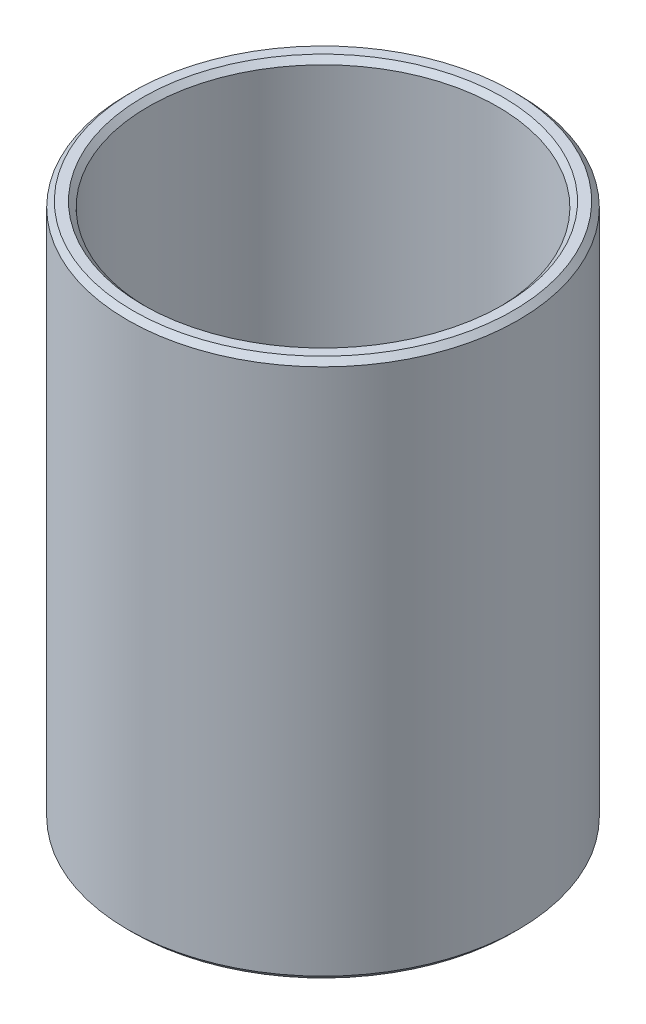
ISO-10303-21;
HEADER;
FILE_DESCRIPTION(('STEP AP214'),'2;1');
FILE_NAME('part.step','',(''),(''),'','','');
FILE_SCHEMA(('AUTOMOTIVE_DESIGN { 1 0 10303 214 1 1 1 1 }'));
ENDSEC;
DATA;
#1=APPLICATION_CONTEXT('core data for automotive mechanical design processes');
#2=APPLICATION_PROTOCOL_DEFINITION('international standard','automotive_design',2000,#1);
#3=PRODUCT_CONTEXT('',#1,'mechanical');
#4=PRODUCT('Part','Part','',(#3));
#5=PRODUCT_RELATED_PRODUCT_CATEGORY('part','',(#4));
#6=PRODUCT_DEFINITION_FORMATION('','',#4);
#7=PRODUCT_DEFINITION_CONTEXT('part definition',#1,'design');
#8=PRODUCT_DEFINITION('design','',#6,#7);
#9=PRODUCT_DEFINITION_SHAPE('','',#8);
#10=(LENGTH_UNIT() NAMED_UNIT(*) SI_UNIT(.MILLI.,.METRE.));
#11=(NAMED_UNIT(*) PLANE_ANGLE_UNIT() SI_UNIT($,.RADIAN.));
#12=(NAMED_UNIT(*) SI_UNIT($,.STERADIAN.) SOLID_ANGLE_UNIT());
#13=UNCERTAINTY_MEASURE_WITH_UNIT(LENGTH_MEASURE(1.E-05),#10,'distance_accuracy_value','');
#14=(GEOMETRIC_REPRESENTATION_CONTEXT(3) GLOBAL_UNCERTAINTY_ASSIGNED_CONTEXT((#13)) GLOBAL_UNIT_ASSIGNED_CONTEXT((#10,
#11,#12)) REPRESENTATION_CONTEXT('',''));
#15=CARTESIAN_POINT('',(0.,0.,0.));
#16=DIRECTION('',(0.,0.,1.));
#17=DIRECTION('',(1.,0.,0.));
#18=AXIS2_PLACEMENT_3D('',#15,#16,#17);
#19=CARTESIAN_POINT('',(0.,165.358222998476,0.));
#20=DIRECTION('',(0.,-1.,0.));
#21=DIRECTION('',(0.,0.,-1.));
#22=AXIS2_PLACEMENT_3D('',#19,#20,#21);
#23=CYLINDRICAL_SURFACE('',#22,60.);
#24=CARTESIAN_POINT('',(0.,1.66099440531534,0.));
#25=DIRECTION('',(0.,1.,0.));
#26=DIRECTION('',(0.,0.,1.));
#27=AXIS2_PLACEMENT_3D('',#24,#25,#26);
#28=CIRCLE('',#27,60.);
#29=CARTESIAN_POINT('',(0.,1.66099440531534,60.));
#30=VERTEX_POINT('',#29);
#31=EDGE_CURVE('E10',#30,#30,#28,.T.);
#32=ORIENTED_EDGE('',*,*,#31,.T.);
#33=EDGE_LOOP('',(#32));
#34=FACE_BOUND('',#33,.T.);
#35=CARTESIAN_POINT('',(0.,163.69722859316,0.));
#36=DIRECTION('',(0.,1.,0.));
#37=DIRECTION('',(0.,0.,1.));
#38=AXIS2_PLACEMENT_3D('',#35,#36,#37);
#39=CIRCLE('',#38,60.);
#40=CARTESIAN_POINT('',(0.,163.69722859316,60.));
#41=VERTEX_POINT('',#40);
#42=EDGE_CURVE('E50',#41,#41,#39,.F.);
#43=ORIENTED_EDGE('',*,*,#42,.T.);
#44=EDGE_LOOP('',(#43));
#45=FACE_BOUND('',#44,.T.);
#46=ADVANCED_FACE('F39',(#34,#45),#23,.T.);
#47=CARTESIAN_POINT('',(0.,165.358222998476,0.));
#48=DIRECTION('',(0.,1.,0.));
#49=DIRECTION('',(0.,0.,1.));
#50=AXIS2_PLACEMENT_3D('',#47,#48,#49);
#51=PLANE('',#50);
#52=CARTESIAN_POINT('',(0.,165.358222998476,0.));
#53=DIRECTION('',(0.,1.,0.));
#54=DIRECTION('',(0.,0.,1.));
#55=AXIS2_PLACEMENT_3D('',#52,#53,#54);
#56=CIRCLE('',#55,55.2725732067462);
#57=CARTESIAN_POINT('',(0.,165.358222998476,55.2725732067462));
#58=VERTEX_POINT('',#57);
#59=EDGE_CURVE('E58',#58,#58,#56,.F.);
#60=ORIENTED_EDGE('',*,*,#59,.T.);
#61=EDGE_LOOP('',(#60));
#62=FACE_BOUND('',#61,.T.);
#63=CARTESIAN_POINT('',(0.,165.358222998476,0.));
#64=DIRECTION('',(0.,1.,0.));
#65=DIRECTION('',(0.,0.,1.));
#66=AXIS2_PLACEMENT_3D('',#63,#64,#65);
#67=CIRCLE('',#66,58.3390055946846);
#68=CARTESIAN_POINT('',(0.,165.358222998476,58.3390055946846));
#69=VERTEX_POINT('',#68);
#70=EDGE_CURVE('E61',#69,#69,#67,.T.);
#71=ORIENTED_EDGE('',*,*,#70,.T.);
#72=EDGE_LOOP('',(#71));
#73=FACE_BOUND('',#72,.T.);
#74=ADVANCED_FACE('F88',(#62,#73),#51,.T.);
#75=CARTESIAN_POINT('',(0.,0.,0.));
#76=DIRECTION('',(0.,1.,0.));
#77=DIRECTION('',(0.,0.,1.));
#78=AXIS2_PLACEMENT_3D('',#75,#76,#77);
#79=PLANE('',#78);
#80=CARTESIAN_POINT('',(0.,0.,0.));
#81=DIRECTION('',(0.,1.,0.));
#82=DIRECTION('',(0.,0.,1.));
#83=AXIS2_PLACEMENT_3D('',#80,#81,#82);
#84=CIRCLE('',#83,55.2725732067462);
#85=CARTESIAN_POINT('',(0.,0.,55.2725732067462));
#86=VERTEX_POINT('',#85);
#87=EDGE_CURVE('E51',#86,#86,#84,.T.);
#88=ORIENTED_EDGE('',*,*,#87,.T.);
#89=EDGE_LOOP('',(#88));
#90=FACE_BOUND('',#89,.T.);
#91=CARTESIAN_POINT('',(0.,0.,0.));
#92=DIRECTION('',(0.,1.,0.));
#93=DIRECTION('',(0.,0.,1.));
#94=AXIS2_PLACEMENT_3D('',#91,#92,#93);
#95=CIRCLE('',#94,58.3390055946847);
#96=CARTESIAN_POINT('',(0.,0.,58.3390055946847));
#97=VERTEX_POINT('',#96);
#98=EDGE_CURVE('E54',#97,#97,#95,.F.);
#99=ORIENTED_EDGE('',*,*,#98,.T.);
#100=EDGE_LOOP('',(#99));
#101=FACE_BOUND('',#100,.T.);
#102=ADVANCED_FACE('F83',(#90,#101),#79,.F.);
#103=CARTESIAN_POINT('',(0.,165.358222998476,0.));
#104=DIRECTION('',(0.,-1.,0.));
#105=DIRECTION('',(0.,0.,-1.));
#106=AXIS2_PLACEMENT_3D('',#103,#104,#105);
#107=CYLINDRICAL_SURFACE('',#106,53.6115788014309);
#108=CARTESIAN_POINT('',(0.,163.69722859316,0.));
#109=DIRECTION('',(0.,1.,0.));
#110=DIRECTION('',(0.,0.,1.));
#111=AXIS2_PLACEMENT_3D('',#108,#109,#110);
#112=CIRCLE('',#111,53.6115788014309);
#113=CARTESIAN_POINT('',(0.,163.69722859316,53.6115788014309));
#114=VERTEX_POINT('',#113);
#115=EDGE_CURVE('E67',#114,#114,#112,.T.);
#116=ORIENTED_EDGE('',*,*,#115,.T.);
#117=EDGE_LOOP('',(#116));
#118=FACE_BOUND('',#117,.T.);
#119=CARTESIAN_POINT('',(0.,1.66099440531531,0.));
#120=DIRECTION('',(0.,1.,0.));
#121=DIRECTION('',(0.,0.,1.));
#122=AXIS2_PLACEMENT_3D('',#119,#120,#121);
#123=CIRCLE('',#122,53.6115788014309);
#124=CARTESIAN_POINT('',(0.,1.66099440531531,53.6115788014309));
#125=VERTEX_POINT('',#124);
#126=EDGE_CURVE('E69',#125,#125,#123,.F.);
#127=ORIENTED_EDGE('',*,*,#126,.T.);
#128=EDGE_LOOP('',(#127));
#129=FACE_BOUND('',#128,.T.);
#130=ADVANCED_FACE('F71',(#118,#129),#107,.F.);
#131=CARTESIAN_POINT('',(0.,163.69722859316,0.));
#132=DIRECTION('',(0.,1.,0.));
#133=DIRECTION('',(0.,0.,1.));
#134=AXIS2_PLACEMENT_3D('',#131,#132,#133);
#135=CONICAL_SURFACE('',#134,53.6115788014309,0.785398163397448);
#136=ORIENTED_EDGE('',*,*,#59,.F.);
#137=EDGE_LOOP('',(#136));
#138=FACE_BOUND('',#137,.T.);
#139=ORIENTED_EDGE('',*,*,#115,.F.);
#140=EDGE_LOOP('',(#139));
#141=FACE_BOUND('',#140,.T.);
#142=ADVANCED_FACE('F77',(#138,#141),#135,.F.);
#143=CARTESIAN_POINT('',(0.,0.,0.));
#144=DIRECTION('',(0.,-1.,0.));
#145=DIRECTION('',(0.,0.,-1.));
#146=AXIS2_PLACEMENT_3D('',#143,#144,#145);
#147=CONICAL_SURFACE('',#146,55.2725732067462,0.785398163397448);
#148=ORIENTED_EDGE('',*,*,#126,.F.);
#149=EDGE_LOOP('',(#148));
#150=FACE_BOUND('',#149,.T.);
#151=ORIENTED_EDGE('',*,*,#87,.F.);
#152=EDGE_LOOP('',(#151));
#153=FACE_BOUND('',#152,.T.);
#154=ADVANCED_FACE('F73',(#150,#153),#147,.F.);
#155=CARTESIAN_POINT('',(0.,1.66099440531534,0.));
#156=DIRECTION('',(0.,1.,0.));
#157=DIRECTION('',(0.,0.,1.));
#158=AXIS2_PLACEMENT_3D('',#155,#156,#157);
#159=CONICAL_SURFACE('',#158,60.,0.785398163397448);
#160=ORIENTED_EDGE('',*,*,#98,.F.);
#161=EDGE_LOOP('',(#160));
#162=FACE_BOUND('',#161,.T.);
#163=ORIENTED_EDGE('',*,*,#31,.F.);
#164=EDGE_LOOP('',(#163));
#165=FACE_BOUND('',#164,.T.);
#166=ADVANCED_FACE('F76',(#162,#165),#159,.T.);
#167=CARTESIAN_POINT('',(0.,165.358222998476,0.));
#168=DIRECTION('',(0.,-1.,0.));
#169=DIRECTION('',(0.,0.,-1.));
#170=AXIS2_PLACEMENT_3D('',#167,#168,#169);
#171=CONICAL_SURFACE('',#170,58.3390055946846,0.785398163397457);
#172=ORIENTED_EDGE('',*,*,#42,.F.);
#173=EDGE_LOOP('',(#172));
#174=FACE_BOUND('',#173,.T.);
#175=ORIENTED_EDGE('',*,*,#70,.F.);
#176=EDGE_LOOP('',(#175));
#177=FACE_BOUND('',#176,.T.);
#178=ADVANCED_FACE('F45',(#174,#177),#171,.T.);
#179=CLOSED_SHELL('',(#46,#74,#102,#130,#142,#154,#166,#178));
#180=MANIFOLD_SOLID_BREP('B2',#179);
#181=ADVANCED_BREP_SHAPE_REPRESENTATION('',(#18,#180),#14);
#182=SHAPE_DEFINITION_REPRESENTATION(#9,#181);
ENDSEC;
END-ISO-10303-21;
